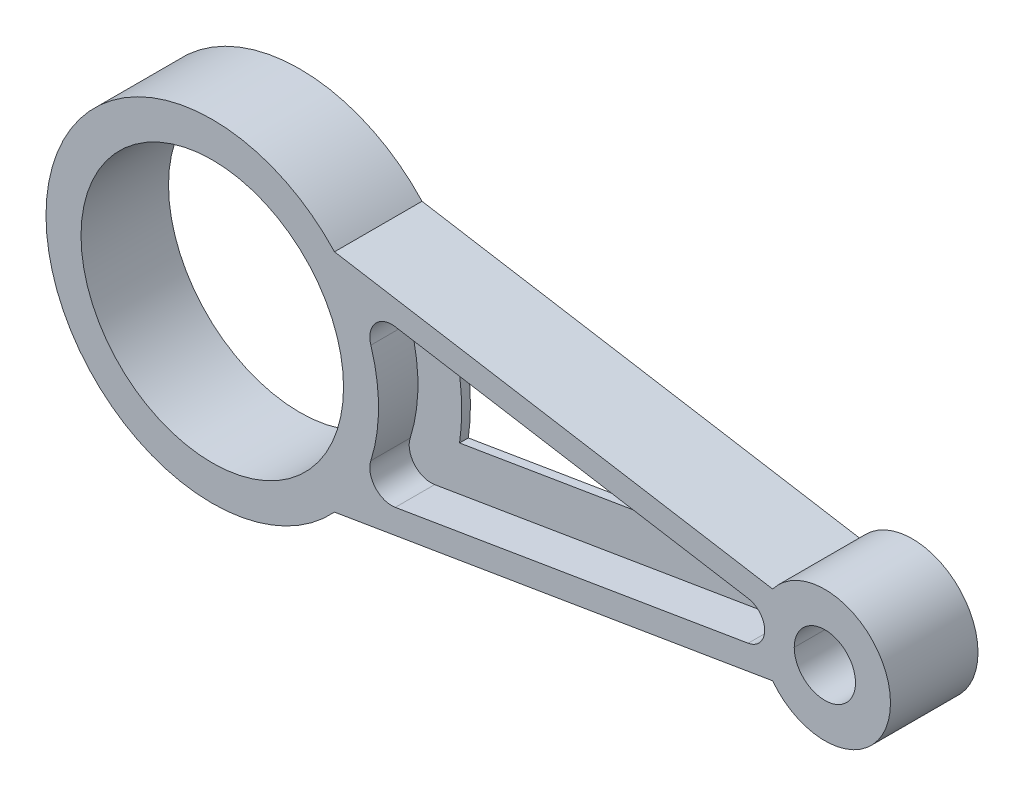
ISO-10303-21;
HEADER;
FILE_DESCRIPTION(('STEP AP214'),'2;1');
FILE_NAME('part.step','',(''),(''),'','','');
FILE_SCHEMA(('AUTOMOTIVE_DESIGN { 1 0 10303 214 1 1 1 1 }'));
ENDSEC;
DATA;
#1=APPLICATION_CONTEXT('core data for automotive mechanical design processes');
#2=APPLICATION_PROTOCOL_DEFINITION('international standard','automotive_design',2000,#1);
#3=PRODUCT_CONTEXT('',#1,'mechanical');
#4=PRODUCT('Part','Part','',(#3));
#5=PRODUCT_RELATED_PRODUCT_CATEGORY('part','',(#4));
#6=PRODUCT_DEFINITION_FORMATION('','',#4);
#7=PRODUCT_DEFINITION_CONTEXT('part definition',#1,'design');
#8=PRODUCT_DEFINITION('design','',#6,#7);
#9=PRODUCT_DEFINITION_SHAPE('','',#8);
#10=(LENGTH_UNIT() NAMED_UNIT(*) SI_UNIT(.MILLI.,.METRE.));
#11=(NAMED_UNIT(*) PLANE_ANGLE_UNIT() SI_UNIT($,.RADIAN.));
#12=(NAMED_UNIT(*) SI_UNIT($,.STERADIAN.) SOLID_ANGLE_UNIT());
#13=UNCERTAINTY_MEASURE_WITH_UNIT(LENGTH_MEASURE(1.E-05),#10,'distance_accuracy_value','');
#14=(GEOMETRIC_REPRESENTATION_CONTEXT(3) GLOBAL_UNCERTAINTY_ASSIGNED_CONTEXT((#13)) GLOBAL_UNIT_ASSIGNED_CONTEXT((#10,
#11,#12)) REPRESENTATION_CONTEXT('',''));
#15=CARTESIAN_POINT('',(0.,0.,0.));
#16=DIRECTION('',(0.,0.,1.));
#17=DIRECTION('',(1.,0.,0.));
#18=AXIS2_PLACEMENT_3D('',#15,#16,#17);
#19=CARTESIAN_POINT('',(41.0071259869049,12.9389187451698,1.));
#20=DIRECTION('',(0.,0.,-1.));
#21=DIRECTION('',(-1.,0.,0.));
#22=AXIS2_PLACEMENT_3D('',#19,#20,#21);
#23=PLANE('',#22);
#24=CARTESIAN_POINT('',(41.0071259869049,12.9389187451698,1.));
#25=DIRECTION('',(0.,0.,1.));
#26=DIRECTION('',(-1.,0.,0.));
#27=AXIS2_PLACEMENT_3D('',#24,#25,#26);
#28=CIRCLE('',#27,5.);
#29=CARTESIAN_POINT('',(41.8285545583335,17.8709827250915,1.));
#30=VERTEX_POINT('',#29);
#31=CARTESIAN_POINT('',(36.2388555233113,11.4343933096849,1.));
#32=VERTEX_POINT('',#31);
#33=EDGE_CURVE('E275',#30,#32,#28,.T.);
#34=ORIENTED_EDGE('',*,*,#33,.T.);
#35=CARTESIAN_POINT('',(0.,0.,1.));
#36=DIRECTION('',(0.,0.,-1.));
#37=DIRECTION('',(-1.,0.,0.));
#38=AXIS2_PLACEMENT_3D('',#35,#36,#37);
#39=CIRCLE('',#38,38.);
#40=CARTESIAN_POINT('',(36.2388555233113,-11.4343933096849,1.));
#41=VERTEX_POINT('',#40);
#42=EDGE_CURVE('E279',#32,#41,#39,.T.);
#43=ORIENTED_EDGE('',*,*,#42,.T.);
#44=CARTESIAN_POINT('',(41.0071259869049,-12.9389187451698,1.));
#45=DIRECTION('',(0.,0.,1.));
#46=DIRECTION('',(1.,0.,0.));
#47=AXIS2_PLACEMENT_3D('',#44,#45,#46);
#48=CIRCLE('',#47,5.);
#49=CARTESIAN_POINT('',(41.8285545583335,-17.8709827250915,1.));
#50=VERTEX_POINT('',#49);
#51=EDGE_CURVE('E284',#41,#50,#48,.T.);
#52=ORIENTED_EDGE('',*,*,#51,.T.);
#53=DIRECTION('',(0.986412795984335,0.164285714285714,0.));
#54=VECTOR('',#53,1.);
#55=CARTESIAN_POINT('',(122.478416149068,-4.4388575819295,1.));
#56=LINE('',#55,#54);
#57=CARTESIAN_POINT('',(122.478416149068,-4.4388575819295,1.));
#58=VERTEX_POINT('',#57);
#59=EDGE_CURVE('E288',#50,#58,#56,.T.);
#60=ORIENTED_EDGE('',*,*,#59,.T.);
#61=CARTESIAN_POINT('',(121.739130434783,0.,1.));
#62=DIRECTION('',(0.,0.,1.));
#63=DIRECTION('',(-1.,0.,0.));
#64=AXIS2_PLACEMENT_3D('',#61,#62,#63);
#65=CIRCLE('',#64,4.49999999999999);
#66=CARTESIAN_POINT('',(122.478416149068,4.4388575819295,1.));
#67=VERTEX_POINT('',#66);
#68=EDGE_CURVE('E292',#58,#67,#65,.T.);
#69=ORIENTED_EDGE('',*,*,#68,.T.);
#70=DIRECTION('',(-0.986412795984335,0.164285714285714,0.));
#71=VECTOR('',#70,1.);
#72=CARTESIAN_POINT('',(41.8285545583335,17.8709827250915,1.));
#73=LINE('',#72,#71);
#74=EDGE_CURVE('E296',#67,#30,#73,.T.);
#75=ORIENTED_EDGE('',*,*,#74,.T.);
#76=EDGE_LOOP('',(#34,#43,#52,#60,#69,#75));
#77=FACE_BOUND('',#76,.T.);
#78=CARTESIAN_POINT('',(0.,0.,1.));
#79=DIRECTION('',(0.,0.,-1.));
#80=DIRECTION('',(1.,0.,0.));
#81=AXIS2_PLACEMENT_3D('',#78,#79,#80);
#82=CIRCLE('',#81,48.);
#83=CARTESIAN_POINT('',(47.5179392364682,6.78567982735085,1.));
#84=VERTEX_POINT('',#83);
#85=CARTESIAN_POINT('',(47.5179392364682,-6.78567982735085,1.));
#86=VERTEX_POINT('',#85);
#87=EDGE_CURVE('E193',#84,#86,#82,.T.);
#88=ORIENTED_EDGE('',*,*,#87,.F.);
#89=DIRECTION('',(-0.986412795984335,0.164285714285714,0.));
#90=VECTOR('',#89,1.);
#91=CARTESIAN_POINT('',(88.2608695652174,0.,1.));
#92=LINE('',#91,#90);
#93=CARTESIAN_POINT('',(88.2608695652174,0.,1.));
#94=VERTEX_POINT('',#93);
#95=EDGE_CURVE('E190',#94,#84,#92,.T.);
#96=ORIENTED_EDGE('',*,*,#95,.F.);
#97=DIRECTION('',(0.986412795984335,0.164285714285714,0.));
#98=VECTOR('',#97,1.);
#99=CARTESIAN_POINT('',(47.5179392364682,-6.78567982735085,1.));
#100=LINE('',#99,#98);
#101=EDGE_CURVE('E59',#86,#94,#100,.T.);
#102=ORIENTED_EDGE('',*,*,#101,.F.);
#103=EDGE_LOOP('',(#88,#96,#102));
#104=FACE_BOUND('',#103,.T.);
#105=ADVANCED_FACE('F43',(#77,#104),#23,.F.);
#106=CARTESIAN_POINT('',(140.,0.,10.));
#107=DIRECTION('',(0.,0.,-1.));
#108=DIRECTION('',(-1.,0.,0.));
#109=AXIS2_PLACEMENT_3D('',#106,#107,#108);
#110=CYLINDRICAL_SURFACE('',#109,7.00000000000001);
#111=CARTESIAN_POINT('',(140.,0.,10.));
#112=DIRECTION('',(0.,0.,1.));
#113=DIRECTION('',(1.,0.,0.));
#114=AXIS2_PLACEMENT_3D('',#111,#112,#113);
#115=CIRCLE('',#114,7.00000000000001);
#116=CARTESIAN_POINT('',(133.,0.,10.));
#117=VERTEX_POINT('',#116);
#118=CARTESIAN_POINT('',(147.,0.,10.));
#119=VERTEX_POINT('',#118);
#120=EDGE_CURVE('E357',#117,#119,#115,.T.);
#121=ORIENTED_EDGE('',*,*,#120,.T.);
#122=DIRECTION('',(0.,0.,-1.));
#123=VECTOR('',#122,1.);
#124=CARTESIAN_POINT('',(147.,0.,10.));
#125=LINE('',#124,#123);
#126=CARTESIAN_POINT('',(147.,0.,-10.));
#127=VERTEX_POINT('',#126);
#128=EDGE_CURVE('E405',#119,#127,#125,.T.);
#129=ORIENTED_EDGE('',*,*,#128,.T.);
#130=CARTESIAN_POINT('',(140.,0.,-10.));
#131=DIRECTION('',(0.,0.,1.));
#132=DIRECTION('',(1.,0.,0.));
#133=AXIS2_PLACEMENT_3D('',#130,#131,#132);
#134=CIRCLE('',#133,7.00000000000001);
#135=CARTESIAN_POINT('',(133.,0.,-10.));
#136=VERTEX_POINT('',#135);
#137=EDGE_CURVE('E381',#136,#127,#134,.T.);
#138=ORIENTED_EDGE('',*,*,#137,.F.);
#139=DIRECTION('',(0.,0.,1.));
#140=VECTOR('',#139,1.);
#141=CARTESIAN_POINT('',(133.,0.,10.));
#142=LINE('',#141,#140);
#143=EDGE_CURVE('E401',#136,#117,#142,.T.);
#144=ORIENTED_EDGE('',*,*,#143,.T.);
#145=EDGE_LOOP('',(#121,#129,#138,#144));
#146=FACE_BOUND('',#145,.T.);
#147=ADVANCED_FACE('F425',(#146),#110,.F.);
#148=CARTESIAN_POINT('',(0.,0.,-10.));
#149=DIRECTION('',(0.,0.,1.));
#150=DIRECTION('',(1.,0.,0.));
#151=AXIS2_PLACEMENT_3D('',#148,#149,#150);
#152=PLANE('',#151);
#153=CARTESIAN_POINT('',(0.,0.,-10.));
#154=DIRECTION('',(0.,0.,1.));
#155=DIRECTION('',(1.,0.,0.));
#156=AXIS2_PLACEMENT_3D('',#153,#154,#155);
#157=CIRCLE('',#156,30.);
#158=CARTESIAN_POINT('',(30.,0.,-10.));
#159=VERTEX_POINT('',#158);
#160=EDGE_CURVE('E346',#159,#159,#157,.T.);
#161=ORIENTED_EDGE('',*,*,#160,.T.);
#162=EDGE_LOOP('',(#161));
#163=FACE_BOUND('',#162,.T.);
#164=ORIENTED_EDGE('',*,*,#137,.T.);
#165=EDGE_CURVE('E380',#127,#136,#134,.T.);
#166=ORIENTED_EDGE('',*,*,#165,.T.);
#167=EDGE_LOOP('',(#164,#166));
#168=FACE_BOUND('',#167,.T.);
#169=DIRECTION('',(0.986412795984335,0.164285714285714,0.));
#170=VECTOR('',#169,1.);
#171=CARTESIAN_POINT('',(4.92857142857142,-29.59238387953,-10.));
#172=LINE('',#171,#170);
#173=CARTESIAN_POINT('',(27.9354736759495,-25.7606154914888,-10.));
#174=VERTEX_POINT('',#173);
#175=CARTESIAN_POINT('',(128.063755469258,-9.08438586269532,-10.));
#176=VERTEX_POINT('',#175);
#177=EDGE_CURVE('E325',#174,#176,#172,.T.);
#178=ORIENTED_EDGE('',*,*,#177,.F.);
#179=CARTESIAN_POINT('',(0.,0.,-10.));
#180=DIRECTION('',(0.,0.,1.));
#181=DIRECTION('',(1.,0.,0.));
#182=AXIS2_PLACEMENT_3D('',#179,#180,#181);
#183=CIRCLE('',#182,38.);
#184=CARTESIAN_POINT('',(27.9354736759495,25.7606154914888,-10.));
#185=VERTEX_POINT('',#184);
#186=EDGE_CURVE('E377',#185,#174,#183,.T.);
#187=ORIENTED_EDGE('',*,*,#186,.F.);
#188=DIRECTION('',(0.986412795984335,-0.164285714285714,0.));
#189=VECTOR('',#188,1.);
#190=CARTESIAN_POINT('',(4.92857142857142,29.59238387953,-10.));
#191=LINE('',#190,#189);
#192=CARTESIAN_POINT('',(128.063755469258,9.08438586269533,-10.));
#193=VERTEX_POINT('',#192);
#194=EDGE_CURVE('E373',#185,#193,#191,.T.);
#195=ORIENTED_EDGE('',*,*,#194,.T.);
#196=CARTESIAN_POINT('',(140.,0.,-10.));
#197=DIRECTION('',(0.,0.,1.));
#198=DIRECTION('',(1.,0.,0.));
#199=AXIS2_PLACEMENT_3D('',#196,#197,#198);
#200=CIRCLE('',#199,15.);
#201=EDGE_CURVE('E369',#176,#193,#200,.T.);
#202=ORIENTED_EDGE('',*,*,#201,.F.);
#203=EDGE_LOOP('',(#178,#187,#195,#202));
#204=FACE_BOUND('',#203,.T.);
#205=CARTESIAN_POINT('',(41.0071259869049,12.9389187451698,-10.));
#206=DIRECTION('',(0.,0.,1.));
#207=DIRECTION('',(-1.,0.,0.));
#208=AXIS2_PLACEMENT_3D('',#205,#206,#207);
#209=CIRCLE('',#208,5.);
#210=CARTESIAN_POINT('',(41.8285545583335,17.8709827250915,-10.));
#211=VERTEX_POINT('',#210);
#212=CARTESIAN_POINT('',(36.2388555233113,11.4343933096849,-10.));
#213=VERTEX_POINT('',#212);
#214=EDGE_CURVE('E209',#211,#213,#209,.T.);
#215=ORIENTED_EDGE('',*,*,#214,.T.);
#216=CARTESIAN_POINT('',(0.,0.,-10.));
#217=DIRECTION('',(0.,0.,-1.));
#218=DIRECTION('',(-1.,0.,0.));
#219=AXIS2_PLACEMENT_3D('',#216,#217,#218);
#220=CIRCLE('',#219,38.);
#221=CARTESIAN_POINT('',(36.2388555233113,-11.4343933096849,-10.));
#222=VERTEX_POINT('',#221);
#223=EDGE_CURVE('E217',#213,#222,#220,.T.);
#224=ORIENTED_EDGE('',*,*,#223,.T.);
#225=CARTESIAN_POINT('',(41.0071259869049,-12.9389187451698,-10.));
#226=DIRECTION('',(0.,0.,1.));
#227=DIRECTION('',(1.,0.,0.));
#228=AXIS2_PLACEMENT_3D('',#225,#226,#227);
#229=CIRCLE('',#228,5.);
#230=CARTESIAN_POINT('',(41.8285545583335,-17.8709827250915,-10.));
#231=VERTEX_POINT('',#230);
#232=EDGE_CURVE('E248',#222,#231,#229,.T.);
#233=ORIENTED_EDGE('',*,*,#232,.T.);
#234=DIRECTION('',(0.986412795984335,0.164285714285714,0.));
#235=VECTOR('',#234,1.);
#236=CARTESIAN_POINT('',(122.478416149068,-4.4388575819295,-10.));
#237=LINE('',#236,#235);
#238=CARTESIAN_POINT('',(122.478416149068,-4.4388575819295,-10.));
#239=VERTEX_POINT('',#238);
#240=EDGE_CURVE('E244',#231,#239,#237,.T.);
#241=ORIENTED_EDGE('',*,*,#240,.T.);
#242=CARTESIAN_POINT('',(121.739130434783,0.,-10.));
#243=DIRECTION('',(0.,0.,1.));
#244=DIRECTION('',(-1.,0.,0.));
#245=AXIS2_PLACEMENT_3D('',#242,#243,#244);
#246=CIRCLE('',#245,4.49999999999999);
#247=CARTESIAN_POINT('',(122.478416149068,4.4388575819295,-10.));
#248=VERTEX_POINT('',#247);
#249=EDGE_CURVE('E240',#239,#248,#246,.T.);
#250=ORIENTED_EDGE('',*,*,#249,.T.);
#251=DIRECTION('',(-0.986412795984335,0.164285714285714,0.));
#252=VECTOR('',#251,1.);
#253=CARTESIAN_POINT('',(41.8285545583335,17.8709827250915,-10.));
#254=LINE('',#253,#252);
#255=EDGE_CURVE('E236',#248,#211,#254,.T.);
#256=ORIENTED_EDGE('',*,*,#255,.T.);
#257=EDGE_LOOP('',(#215,#224,#233,#241,#250,#256));
#258=FACE_BOUND('',#257,.T.);
#259=ADVANCED_FACE('F431',(#163,#168,#204,#258),#152,.F.);
#260=CARTESIAN_POINT('',(0.,0.,10.));
#261=DIRECTION('',(0.,0.,1.));
#262=DIRECTION('',(1.,0.,0.));
#263=AXIS2_PLACEMENT_3D('',#260,#261,#262);
#264=PLANE('',#263);
#265=CARTESIAN_POINT('',(0.,0.,10.));
#266=DIRECTION('',(0.,0.,1.));
#267=DIRECTION('',(1.,0.,0.));
#268=AXIS2_PLACEMENT_3D('',#265,#266,#267);
#269=CIRCLE('',#268,30.);
#270=CARTESIAN_POINT('',(30.,0.,10.));
#271=VERTEX_POINT('',#270);
#272=EDGE_CURVE('E361',#271,#271,#269,.T.);
#273=ORIENTED_EDGE('',*,*,#272,.F.);
#274=EDGE_LOOP('',(#273));
#275=FACE_BOUND('',#274,.T.);
#276=ORIENTED_EDGE('',*,*,#120,.F.);
#277=EDGE_CURVE('E356',#119,#117,#115,.T.);
#278=ORIENTED_EDGE('',*,*,#277,.F.);
#279=EDGE_LOOP('',(#276,#278));
#280=FACE_BOUND('',#279,.T.);
#281=DIRECTION('',(0.986412795984335,0.164285714285714,0.));
#282=VECTOR('',#281,1.);
#283=CARTESIAN_POINT('',(4.92857142857142,-29.59238387953,10.));
#284=LINE('',#283,#282);
#285=CARTESIAN_POINT('',(27.9354736759495,-25.7606154914888,10.));
#286=VERTEX_POINT('',#285);
#287=CARTESIAN_POINT('',(128.063755469258,-9.08438586269532,10.));
#288=VERTEX_POINT('',#287);
#289=EDGE_CURVE('E341',#286,#288,#284,.T.);
#290=ORIENTED_EDGE('',*,*,#289,.T.);
#291=CARTESIAN_POINT('',(140.,0.,10.));
#292=DIRECTION('',(0.,0.,1.));
#293=DIRECTION('',(1.,0.,0.));
#294=AXIS2_PLACEMENT_3D('',#291,#292,#293);
#295=CIRCLE('',#294,15.);
#296=CARTESIAN_POINT('',(128.063755469258,9.08438586269533,10.));
#297=VERTEX_POINT('',#296);
#298=EDGE_CURVE('E345',#288,#297,#295,.T.);
#299=ORIENTED_EDGE('',*,*,#298,.T.);
#300=DIRECTION('',(0.986412795984335,-0.164285714285714,0.));
#301=VECTOR('',#300,1.);
#302=CARTESIAN_POINT('',(4.92857142857142,29.59238387953,10.));
#303=LINE('',#302,#301);
#304=CARTESIAN_POINT('',(27.9354736759495,25.7606154914888,10.));
#305=VERTEX_POINT('',#304);
#306=EDGE_CURVE('E349',#305,#297,#303,.T.);
#307=ORIENTED_EDGE('',*,*,#306,.F.);
#308=CARTESIAN_POINT('',(0.,0.,10.));
#309=DIRECTION('',(0.,0.,1.));
#310=DIRECTION('',(1.,0.,0.));
#311=AXIS2_PLACEMENT_3D('',#308,#309,#310);
#312=CIRCLE('',#311,38.);
#313=EDGE_CURVE('E353',#305,#286,#312,.T.);
#314=ORIENTED_EDGE('',*,*,#313,.T.);
#315=EDGE_LOOP('',(#290,#299,#307,#314));
#316=FACE_BOUND('',#315,.T.);
#317=CARTESIAN_POINT('',(41.0071259869049,12.9389187451698,10.));
#318=DIRECTION('',(0.,0.,1.));
#319=DIRECTION('',(-1.,0.,0.));
#320=AXIS2_PLACEMENT_3D('',#317,#318,#319);
#321=CIRCLE('',#320,5.);
#322=CARTESIAN_POINT('',(41.8285545583335,17.8709827250915,10.));
#323=VERTEX_POINT('',#322);
#324=CARTESIAN_POINT('',(36.2388555233113,11.4343933096849,10.));
#325=VERTEX_POINT('',#324);
#326=EDGE_CURVE('E259',#323,#325,#321,.T.);
#327=ORIENTED_EDGE('',*,*,#326,.F.);
#328=DIRECTION('',(-0.986412795984335,0.164285714285714,0.));
#329=VECTOR('',#328,1.);
#330=CARTESIAN_POINT('',(41.8285545583335,17.8709827250915,10.));
#331=LINE('',#330,#329);
#332=CARTESIAN_POINT('',(122.478416149068,4.4388575819295,10.));
#333=VERTEX_POINT('',#332);
#334=EDGE_CURVE('E280',#333,#323,#331,.T.);
#335=ORIENTED_EDGE('',*,*,#334,.F.);
#336=CARTESIAN_POINT('',(121.739130434783,0.,10.));
#337=DIRECTION('',(0.,0.,1.));
#338=DIRECTION('',(-1.,0.,0.));
#339=AXIS2_PLACEMENT_3D('',#336,#337,#338);
#340=CIRCLE('',#339,4.49999999999999);
#341=CARTESIAN_POINT('',(122.478416149068,-4.4388575819295,10.));
#342=VERTEX_POINT('',#341);
#343=EDGE_CURVE('E315',#342,#333,#340,.T.);
#344=ORIENTED_EDGE('',*,*,#343,.F.);
#345=DIRECTION('',(0.986412795984335,0.164285714285714,0.));
#346=VECTOR('',#345,1.);
#347=CARTESIAN_POINT('',(122.478416149068,-4.4388575819295,10.));
#348=LINE('',#347,#346);
#349=CARTESIAN_POINT('',(41.8285545583335,-17.8709827250915,10.));
#350=VERTEX_POINT('',#349);
#351=EDGE_CURVE('E311',#350,#342,#348,.T.);
#352=ORIENTED_EDGE('',*,*,#351,.F.);
#353=CARTESIAN_POINT('',(41.0071259869049,-12.9389187451698,10.));
#354=DIRECTION('',(0.,0.,1.));
#355=DIRECTION('',(1.,0.,0.));
#356=AXIS2_PLACEMENT_3D('',#353,#354,#355);
#357=CIRCLE('',#356,5.);
#358=CARTESIAN_POINT('',(36.2388555233113,-11.4343933096849,10.));
#359=VERTEX_POINT('',#358);
#360=EDGE_CURVE('E307',#359,#350,#357,.T.);
#361=ORIENTED_EDGE('',*,*,#360,.F.);
#362=CARTESIAN_POINT('',(0.,0.,10.));
#363=DIRECTION('',(0.,0.,-1.));
#364=DIRECTION('',(-1.,0.,0.));
#365=AXIS2_PLACEMENT_3D('',#362,#363,#364);
#366=CIRCLE('',#365,38.);
#367=EDGE_CURVE('E303',#325,#359,#366,.T.);
#368=ORIENTED_EDGE('',*,*,#367,.F.);
#369=EDGE_LOOP('',(#327,#335,#344,#352,#361,#368));
#370=FACE_BOUND('',#369,.T.);
#371=ADVANCED_FACE('F464',(#275,#280,#316,#370),#264,.T.);
#372=CARTESIAN_POINT('',(4.92857142857142,-29.59238387953,10.));
#373=DIRECTION('',(-0.164285714285714,0.986412795984335,0.));
#374=DIRECTION('',(-0.986412795984335,-0.164285714285714,0.));
#375=AXIS2_PLACEMENT_3D('',#372,#373,#374);
#376=PLANE('',#375);
#377=ORIENTED_EDGE('',*,*,#177,.T.);
#378=DIRECTION('',(0.,0.,-1.));
#379=VECTOR('',#378,1.);
#380=CARTESIAN_POINT('',(128.063755469258,-9.08438586269532,10.));
#381=LINE('',#380,#379);
#382=EDGE_CURVE('E397',#288,#176,#381,.T.);
#383=ORIENTED_EDGE('',*,*,#382,.F.);
#384=ORIENTED_EDGE('',*,*,#289,.F.);
#385=DIRECTION('',(0.,0.,-1.));
#386=VECTOR('',#385,1.);
#387=CARTESIAN_POINT('',(27.9354736759495,-25.7606154914888,10.));
#388=LINE('',#387,#386);
#389=EDGE_CURVE('E365',#286,#174,#388,.T.);
#390=ORIENTED_EDGE('',*,*,#389,.T.);
#391=EDGE_LOOP('',(#377,#383,#384,#390));
#392=FACE_BOUND('',#391,.T.);
#393=ADVANCED_FACE('F45',(#392),#376,.F.);
#394=CARTESIAN_POINT('',(140.,0.,10.));
#395=DIRECTION('',(0.,0.,-1.));
#396=DIRECTION('',(-1.,0.,0.));
#397=AXIS2_PLACEMENT_3D('',#394,#395,#396);
#398=CYLINDRICAL_SURFACE('',#397,15.);
#399=ORIENTED_EDGE('',*,*,#201,.T.);
#400=DIRECTION('',(0.,0.,-1.));
#401=VECTOR('',#400,1.);
#402=CARTESIAN_POINT('',(128.063755469258,9.08438586269533,10.));
#403=LINE('',#402,#401);
#404=EDGE_CURVE('E394',#297,#193,#403,.T.);
#405=ORIENTED_EDGE('',*,*,#404,.F.);
#406=ORIENTED_EDGE('',*,*,#298,.F.);
#407=ORIENTED_EDGE('',*,*,#382,.T.);
#408=EDGE_LOOP('',(#399,#405,#406,#407));
#409=FACE_BOUND('',#408,.T.);
#410=ADVANCED_FACE('F482',(#409),#398,.T.);
#411=CARTESIAN_POINT('',(4.92857142857142,29.59238387953,10.));
#412=DIRECTION('',(0.164285714285714,0.986412795984335,0.));
#413=DIRECTION('',(-0.986412795984335,0.164285714285714,0.));
#414=AXIS2_PLACEMENT_3D('',#411,#412,#413);
#415=PLANE('',#414);
#416=ORIENTED_EDGE('',*,*,#194,.F.);
#417=DIRECTION('',(0.,0.,-1.));
#418=VECTOR('',#417,1.);
#419=CARTESIAN_POINT('',(27.9354736759495,25.7606154914888,10.));
#420=LINE('',#419,#418);
#421=EDGE_CURVE('E391',#305,#185,#420,.T.);
#422=ORIENTED_EDGE('',*,*,#421,.F.);
#423=ORIENTED_EDGE('',*,*,#306,.T.);
#424=ORIENTED_EDGE('',*,*,#404,.T.);
#425=EDGE_LOOP('',(#416,#422,#423,#424));
#426=FACE_BOUND('',#425,.T.);
#427=ADVANCED_FACE('F476',(#426),#415,.T.);
#428=ORIENTED_EDGE('',*,*,#128,.F.);
#429=ORIENTED_EDGE('',*,*,#277,.T.);
#430=ORIENTED_EDGE('',*,*,#143,.F.);
#431=ORIENTED_EDGE('',*,*,#165,.F.);
#432=EDGE_LOOP('',(#428,#429,#430,#431));
#433=FACE_BOUND('',#432,.T.);
#434=ADVANCED_FACE('F434',(#433),#110,.F.);
#435=CARTESIAN_POINT('',(0.,0.,10.));
#436=DIRECTION('',(0.,0.,-1.));
#437=DIRECTION('',(-1.,0.,0.));
#438=AXIS2_PLACEMENT_3D('',#435,#436,#437);
#439=CYLINDRICAL_SURFACE('',#438,38.);
#440=ORIENTED_EDGE('',*,*,#186,.T.);
#441=ORIENTED_EDGE('',*,*,#389,.F.);
#442=ORIENTED_EDGE('',*,*,#313,.F.);
#443=ORIENTED_EDGE('',*,*,#421,.T.);
#444=EDGE_LOOP('',(#440,#441,#442,#443));
#445=FACE_BOUND('',#444,.T.);
#446=ADVANCED_FACE('F472',(#445),#439,.T.);
#447=CARTESIAN_POINT('',(0.,0.,10.));
#448=DIRECTION('',(0.,0.,-1.));
#449=DIRECTION('',(-1.,0.,0.));
#450=AXIS2_PLACEMENT_3D('',#447,#448,#449);
#451=CYLINDRICAL_SURFACE('',#450,30.);
#452=ORIENTED_EDGE('',*,*,#272,.T.);
#453=EDGE_LOOP('',(#452));
#454=FACE_BOUND('',#453,.T.);
#455=ORIENTED_EDGE('',*,*,#160,.F.);
#456=EDGE_LOOP('',(#455));
#457=FACE_BOUND('',#456,.T.);
#458=ADVANCED_FACE('F462',(#454,#457),#451,.F.);
#459=CARTESIAN_POINT('',(41.0071259869049,12.9389187451698,1.));
#460=DIRECTION('',(0.,0.,1.));
#461=DIRECTION('',(1.,0.,0.));
#462=AXIS2_PLACEMENT_3D('',#459,#460,#461);
#463=CYLINDRICAL_SURFACE('',#462,5.);
#464=ORIENTED_EDGE('',*,*,#326,.T.);
#465=DIRECTION('',(0.,0.,1.));
#466=VECTOR('',#465,1.);
#467=CARTESIAN_POINT('',(36.2388555233113,11.4343933096849,1.));
#468=LINE('',#467,#466);
#469=EDGE_CURVE('E300',#32,#325,#468,.T.);
#470=ORIENTED_EDGE('',*,*,#469,.F.);
#471=ORIENTED_EDGE('',*,*,#33,.F.);
#472=DIRECTION('',(0.,0.,1.));
#473=VECTOR('',#472,1.);
#474=CARTESIAN_POINT('',(41.8285545583335,17.8709827250915,1.));
#475=LINE('',#474,#473);
#476=EDGE_CURVE('E322',#30,#323,#475,.T.);
#477=ORIENTED_EDGE('',*,*,#476,.T.);
#478=EDGE_LOOP('',(#464,#470,#471,#477));
#479=FACE_BOUND('',#478,.T.);
#480=ADVANCED_FACE('F443',(#479),#463,.F.);
#481=CARTESIAN_POINT('',(41.8285545583335,17.8709827250915,1.));
#482=DIRECTION('',(0.164285714285714,0.986412795984335,0.));
#483=DIRECTION('',(-0.986412795984335,0.164285714285714,0.));
#484=AXIS2_PLACEMENT_3D('',#481,#482,#483);
#485=PLANE('',#484);
#486=ORIENTED_EDGE('',*,*,#334,.T.);
#487=ORIENTED_EDGE('',*,*,#476,.F.);
#488=ORIENTED_EDGE('',*,*,#74,.F.);
#489=DIRECTION('',(0.,0.,1.));
#490=VECTOR('',#489,1.);
#491=CARTESIAN_POINT('',(122.478416149068,4.4388575819295,1.));
#492=LINE('',#491,#490);
#493=EDGE_CURVE('E326',#67,#333,#492,.T.);
#494=ORIENTED_EDGE('',*,*,#493,.T.);
#495=EDGE_LOOP('',(#486,#487,#488,#494));
#496=FACE_BOUND('',#495,.T.);
#497=ADVANCED_FACE('F439',(#496),#485,.F.);
#498=CARTESIAN_POINT('',(121.739130434783,0.,1.));
#499=DIRECTION('',(0.,0.,1.));
#500=DIRECTION('',(1.,0.,0.));
#501=AXIS2_PLACEMENT_3D('',#498,#499,#500);
#502=CYLINDRICAL_SURFACE('',#501,4.49999999999999);
#503=ORIENTED_EDGE('',*,*,#343,.T.);
#504=ORIENTED_EDGE('',*,*,#493,.F.);
#505=ORIENTED_EDGE('',*,*,#68,.F.);
#506=DIRECTION('',(0.,0.,1.));
#507=VECTOR('',#506,1.);
#508=CARTESIAN_POINT('',(122.478416149068,-4.4388575819295,1.));
#509=LINE('',#508,#507);
#510=EDGE_CURVE('E329',#58,#342,#509,.T.);
#511=ORIENTED_EDGE('',*,*,#510,.T.);
#512=EDGE_LOOP('',(#503,#504,#505,#511));
#513=FACE_BOUND('',#512,.T.);
#514=ADVANCED_FACE('F442',(#513),#502,.F.);
#515=CARTESIAN_POINT('',(122.478416149068,-4.4388575819295,1.));
#516=DIRECTION('',(0.164285714285714,-0.986412795984335,0.));
#517=DIRECTION('',(0.986412795984335,0.164285714285714,0.));
#518=AXIS2_PLACEMENT_3D('',#515,#516,#517);
#519=PLANE('',#518);
#520=ORIENTED_EDGE('',*,*,#351,.T.);
#521=ORIENTED_EDGE('',*,*,#510,.F.);
#522=ORIENTED_EDGE('',*,*,#59,.F.);
#523=DIRECTION('',(0.,0.,1.));
#524=VECTOR('',#523,1.);
#525=CARTESIAN_POINT('',(41.8285545583335,-17.8709827250915,1.));
#526=LINE('',#525,#524);
#527=EDGE_CURVE('E332',#50,#350,#526,.T.);
#528=ORIENTED_EDGE('',*,*,#527,.T.);
#529=EDGE_LOOP('',(#520,#521,#522,#528));
#530=FACE_BOUND('',#529,.T.);
#531=ADVANCED_FACE('F447',(#530),#519,.F.);
#532=CARTESIAN_POINT('',(41.0071259869049,-12.9389187451698,1.));
#533=DIRECTION('',(0.,0.,1.));
#534=DIRECTION('',(1.,0.,0.));
#535=AXIS2_PLACEMENT_3D('',#532,#533,#534);
#536=CYLINDRICAL_SURFACE('',#535,5.);
#537=ORIENTED_EDGE('',*,*,#360,.T.);
#538=ORIENTED_EDGE('',*,*,#527,.F.);
#539=ORIENTED_EDGE('',*,*,#51,.F.);
#540=DIRECTION('',(0.,0.,1.));
#541=VECTOR('',#540,1.);
#542=CARTESIAN_POINT('',(36.2388555233113,-11.4343933096849,1.));
#543=LINE('',#542,#541);
#544=EDGE_CURVE('E335',#41,#359,#543,.T.);
#545=ORIENTED_EDGE('',*,*,#544,.T.);
#546=EDGE_LOOP('',(#537,#538,#539,#545));
#547=FACE_BOUND('',#546,.T.);
#548=ADVANCED_FACE('F451',(#547),#536,.F.);
#549=CARTESIAN_POINT('',(0.,0.,1.));
#550=DIRECTION('',(0.,0.,1.));
#551=DIRECTION('',(1.,0.,0.));
#552=AXIS2_PLACEMENT_3D('',#549,#550,#551);
#553=CYLINDRICAL_SURFACE('',#552,38.);
#554=ORIENTED_EDGE('',*,*,#367,.T.);
#555=ORIENTED_EDGE('',*,*,#544,.F.);
#556=ORIENTED_EDGE('',*,*,#42,.F.);
#557=ORIENTED_EDGE('',*,*,#469,.T.);
#558=EDGE_LOOP('',(#554,#555,#556,#557));
#559=FACE_BOUND('',#558,.T.);
#560=ADVANCED_FACE('F455',(#559),#553,.T.);
#561=CARTESIAN_POINT('',(41.0071259869049,12.9389187451698,-1.));
#562=DIRECTION('',(0.,0.,-1.));
#563=DIRECTION('',(-1.,0.,0.));
#564=AXIS2_PLACEMENT_3D('',#561,#562,#563);
#565=CYLINDRICAL_SURFACE('',#564,5.);
#566=ORIENTED_EDGE('',*,*,#214,.F.);
#567=DIRECTION('',(0.,0.,-1.));
#568=VECTOR('',#567,1.);
#569=CARTESIAN_POINT('',(41.8285545583335,17.8709827250915,-1.));
#570=LINE('',#569,#568);
#571=CARTESIAN_POINT('',(41.8285545583335,17.8709827250915,-1.));
#572=VERTEX_POINT('',#571);
#573=EDGE_CURVE('E232',#572,#211,#570,.T.);
#574=ORIENTED_EDGE('',*,*,#573,.F.);
#575=CARTESIAN_POINT('',(41.0071259869049,12.9389187451698,-1.));
#576=DIRECTION('',(0.,0.,1.));
#577=DIRECTION('',(-1.,0.,0.));
#578=AXIS2_PLACEMENT_3D('',#575,#576,#577);
#579=CIRCLE('',#578,5.);
#580=CARTESIAN_POINT('',(36.2388555233113,11.4343933096849,-1.));
#581=VERTEX_POINT('',#580);
#582=EDGE_CURVE('E212',#572,#581,#579,.T.);
#583=ORIENTED_EDGE('',*,*,#582,.T.);
#584=DIRECTION('',(0.,0.,-1.));
#585=VECTOR('',#584,1.);
#586=CARTESIAN_POINT('',(36.2388555233113,11.4343933096849,-1.));
#587=LINE('',#586,#585);
#588=EDGE_CURVE('E255',#581,#213,#587,.T.);
#589=ORIENTED_EDGE('',*,*,#588,.T.);
#590=EDGE_LOOP('',(#566,#574,#583,#589));
#591=FACE_BOUND('',#590,.T.);
#592=ADVANCED_FACE('F437',(#591),#565,.F.);
#593=CARTESIAN_POINT('',(0.,0.,-1.));
#594=DIRECTION('',(0.,0.,-1.));
#595=DIRECTION('',(-1.,0.,0.));
#596=AXIS2_PLACEMENT_3D('',#593,#594,#595);
#597=CYLINDRICAL_SURFACE('',#596,38.);
#598=ORIENTED_EDGE('',*,*,#223,.F.);
#599=ORIENTED_EDGE('',*,*,#588,.F.);
#600=CARTESIAN_POINT('',(0.,0.,-1.));
#601=DIRECTION('',(0.,0.,-1.));
#602=DIRECTION('',(-1.,0.,0.));
#603=AXIS2_PLACEMENT_3D('',#600,#601,#602);
#604=CIRCLE('',#603,38.);
#605=CARTESIAN_POINT('',(36.2388555233113,-11.4343933096849,-1.));
#606=VERTEX_POINT('',#605);
#607=EDGE_CURVE('E229',#581,#606,#604,.T.);
#608=ORIENTED_EDGE('',*,*,#607,.T.);
#609=DIRECTION('',(0.,0.,-1.));
#610=VECTOR('',#609,1.);
#611=CARTESIAN_POINT('',(36.2388555233113,-11.4343933096849,-1.));
#612=LINE('',#611,#610);
#613=EDGE_CURVE('E260',#606,#222,#612,.T.);
#614=ORIENTED_EDGE('',*,*,#613,.T.);
#615=EDGE_LOOP('',(#598,#599,#608,#614));
#616=FACE_BOUND('',#615,.T.);
#617=ADVANCED_FACE('F528',(#616),#597,.T.);
#618=CARTESIAN_POINT('',(41.0071259869049,-12.9389187451698,-1.));
#619=DIRECTION('',(0.,0.,-1.));
#620=DIRECTION('',(-1.,0.,0.));
#621=AXIS2_PLACEMENT_3D('',#618,#619,#620);
#622=CYLINDRICAL_SURFACE('',#621,5.);
#623=ORIENTED_EDGE('',*,*,#232,.F.);
#624=ORIENTED_EDGE('',*,*,#613,.F.);
#625=CARTESIAN_POINT('',(41.0071259869049,-12.9389187451698,-1.));
#626=DIRECTION('',(0.,0.,1.));
#627=DIRECTION('',(1.,0.,0.));
#628=AXIS2_PLACEMENT_3D('',#625,#626,#627);
#629=CIRCLE('',#628,5.);
#630=CARTESIAN_POINT('',(41.8285545583335,-17.8709827250915,-1.));
#631=VERTEX_POINT('',#630);
#632=EDGE_CURVE('E226',#606,#631,#629,.T.);
#633=ORIENTED_EDGE('',*,*,#632,.T.);
#634=DIRECTION('',(0.,0.,-1.));
#635=VECTOR('',#634,1.);
#636=CARTESIAN_POINT('',(41.8285545583335,-17.8709827250915,-1.));
#637=LINE('',#636,#635);
#638=EDGE_CURVE('E263',#631,#231,#637,.T.);
#639=ORIENTED_EDGE('',*,*,#638,.T.);
#640=EDGE_LOOP('',(#623,#624,#633,#639));
#641=FACE_BOUND('',#640,.T.);
#642=ADVANCED_FACE('F532',(#641),#622,.F.);
#643=CARTESIAN_POINT('',(122.478416149068,-4.4388575819295,-1.));
#644=DIRECTION('',(-0.164285714285714,0.986412795984335,0.));
#645=DIRECTION('',(-0.986412795984335,-0.164285714285714,0.));
#646=AXIS2_PLACEMENT_3D('',#643,#644,#645);
#647=PLANE('',#646);
#648=ORIENTED_EDGE('',*,*,#240,.F.);
#649=ORIENTED_EDGE('',*,*,#638,.F.);
#650=DIRECTION('',(0.986412795984335,0.164285714285714,0.));
#651=VECTOR('',#650,1.);
#652=CARTESIAN_POINT('',(122.478416149068,-4.4388575819295,-1.));
#653=LINE('',#652,#651);
#654=CARTESIAN_POINT('',(122.478416149068,-4.4388575819295,-1.));
#655=VERTEX_POINT('',#654);
#656=EDGE_CURVE('E223',#631,#655,#653,.T.);
#657=ORIENTED_EDGE('',*,*,#656,.T.);
#658=DIRECTION('',(0.,0.,-1.));
#659=VECTOR('',#658,1.);
#660=CARTESIAN_POINT('',(122.478416149068,-4.4388575819295,-1.));
#661=LINE('',#660,#659);
#662=EDGE_CURVE('E266',#655,#239,#661,.T.);
#663=ORIENTED_EDGE('',*,*,#662,.T.);
#664=EDGE_LOOP('',(#648,#649,#657,#663));
#665=FACE_BOUND('',#664,.T.);
#666=ADVANCED_FACE('F537',(#665),#647,.T.);
#667=CARTESIAN_POINT('',(121.739130434783,0.,-1.));
#668=DIRECTION('',(0.,0.,-1.));
#669=DIRECTION('',(-1.,0.,0.));
#670=AXIS2_PLACEMENT_3D('',#667,#668,#669);
#671=CYLINDRICAL_SURFACE('',#670,4.49999999999999);
#672=ORIENTED_EDGE('',*,*,#249,.F.);
#673=ORIENTED_EDGE('',*,*,#662,.F.);
#674=CARTESIAN_POINT('',(121.739130434783,0.,-1.));
#675=DIRECTION('',(0.,0.,1.));
#676=DIRECTION('',(-1.,0.,0.));
#677=AXIS2_PLACEMENT_3D('',#674,#675,#676);
#678=CIRCLE('',#677,4.49999999999999);
#679=CARTESIAN_POINT('',(122.478416149068,4.4388575819295,-1.));
#680=VERTEX_POINT('',#679);
#681=EDGE_CURVE('E220',#655,#680,#678,.T.);
#682=ORIENTED_EDGE('',*,*,#681,.T.);
#683=DIRECTION('',(0.,0.,-1.));
#684=VECTOR('',#683,1.);
#685=CARTESIAN_POINT('',(122.478416149068,4.4388575819295,-1.));
#686=LINE('',#685,#684);
#687=EDGE_CURVE('E269',#680,#248,#686,.T.);
#688=ORIENTED_EDGE('',*,*,#687,.T.);
#689=EDGE_LOOP('',(#672,#673,#682,#688));
#690=FACE_BOUND('',#689,.T.);
#691=ADVANCED_FACE('F540',(#690),#671,.F.);
#692=CARTESIAN_POINT('',(41.8285545583335,17.8709827250915,-1.));
#693=DIRECTION('',(-0.164285714285714,-0.986412795984335,0.));
#694=DIRECTION('',(0.986412795984335,-0.164285714285714,0.));
#695=AXIS2_PLACEMENT_3D('',#692,#693,#694);
#696=PLANE('',#695);
#697=ORIENTED_EDGE('',*,*,#255,.F.);
#698=ORIENTED_EDGE('',*,*,#687,.F.);
#699=DIRECTION('',(-0.986412795984335,0.164285714285714,0.));
#700=VECTOR('',#699,1.);
#701=CARTESIAN_POINT('',(41.8285545583335,17.8709827250915,-1.));
#702=LINE('',#701,#700);
#703=EDGE_CURVE('E216',#680,#572,#702,.T.);
#704=ORIENTED_EDGE('',*,*,#703,.T.);
#705=ORIENTED_EDGE('',*,*,#573,.T.);
#706=EDGE_LOOP('',(#697,#698,#704,#705));
#707=FACE_BOUND('',#706,.T.);
#708=ADVANCED_FACE('F521',(#707),#696,.T.);
#709=CARTESIAN_POINT('',(41.0071259869049,12.9389187451698,-1.));
#710=DIRECTION('',(0.,0.,1.));
#711=DIRECTION('',(-1.,0.,0.));
#712=AXIS2_PLACEMENT_3D('',#709,#710,#711);
#713=PLANE('',#712);
#714=DIRECTION('',(-0.986412795984335,0.164285714285714,0.));
#715=VECTOR('',#714,1.);
#716=CARTESIAN_POINT('',(40.1856974154764,8.0068547652481,-1.));
#717=LINE('',#716,#715);
#718=CARTESIAN_POINT('',(88.2608695652174,0.,-1.));
#719=VERTEX_POINT('',#718);
#720=CARTESIAN_POINT('',(47.5179392364682,6.78567982735085,-1.));
#721=VERTEX_POINT('',#720);
#722=EDGE_CURVE('E52',#719,#721,#717,.T.);
#723=ORIENTED_EDGE('',*,*,#722,.T.);
#724=CARTESIAN_POINT('',(0.,0.,-1.));
#725=DIRECTION('',(0.,0.,1.));
#726=DIRECTION('',(1.,0.,0.));
#727=AXIS2_PLACEMENT_3D('',#724,#725,#726);
#728=CIRCLE('',#727,48.);
#729=CARTESIAN_POINT('',(47.5179392364682,-6.78567982735085,-1.));
#730=VERTEX_POINT('',#729);
#731=EDGE_CURVE('E11',#721,#730,#728,.F.);
#732=ORIENTED_EDGE('',*,*,#731,.T.);
#733=DIRECTION('',(0.986412795984335,0.164285714285714,0.));
#734=VECTOR('',#733,1.);
#735=CARTESIAN_POINT('',(44.3792923494485,-7.30841721257517,-1.));
#736=LINE('',#735,#734);
#737=EDGE_CURVE('E187',#730,#719,#736,.T.);
#738=ORIENTED_EDGE('',*,*,#737,.T.);
#739=EDGE_LOOP('',(#723,#732,#738));
#740=FACE_BOUND('',#739,.T.);
#741=ORIENTED_EDGE('',*,*,#582,.F.);
#742=ORIENTED_EDGE('',*,*,#703,.F.);
#743=ORIENTED_EDGE('',*,*,#681,.F.);
#744=ORIENTED_EDGE('',*,*,#656,.F.);
#745=ORIENTED_EDGE('',*,*,#632,.F.);
#746=ORIENTED_EDGE('',*,*,#607,.F.);
#747=EDGE_LOOP('',(#741,#742,#743,#744,#745,#746));
#748=FACE_BOUND('',#747,.T.);
#749=ADVANCED_FACE('F412',(#740,#748),#713,.F.);
#750=CARTESIAN_POINT('',(0.,0.,-10.));
#751=DIRECTION('',(0.,0.,1.));
#752=DIRECTION('',(1.,0.,0.));
#753=AXIS2_PLACEMENT_3D('',#750,#751,#752);
#754=CYLINDRICAL_SURFACE('',#753,48.);
#755=DIRECTION('',(0.,0.,1.));
#756=VECTOR('',#755,1.);
#757=CARTESIAN_POINT('',(47.5179392364682,6.78567982735085,-10.));
#758=LINE('',#757,#756);
#759=EDGE_CURVE('E196',#721,#84,#758,.T.);
#760=ORIENTED_EDGE('',*,*,#759,.T.);
#761=ORIENTED_EDGE('',*,*,#87,.T.);
#762=DIRECTION('',(0.,0.,1.));
#763=VECTOR('',#762,1.);
#764=CARTESIAN_POINT('',(47.5179392364682,-6.78567982735085,-10.));
#765=LINE('',#764,#763);
#766=EDGE_CURVE('E183',#730,#86,#765,.T.);
#767=ORIENTED_EDGE('',*,*,#766,.F.);
#768=ORIENTED_EDGE('',*,*,#731,.F.);
#769=EDGE_LOOP('',(#760,#761,#767,#768));
#770=FACE_BOUND('',#769,.T.);
#771=ADVANCED_FACE('F194',(#770),#754,.T.);
#772=CARTESIAN_POINT('',(88.2608695652174,0.,-10.));
#773=DIRECTION('',(0.164285714285714,0.986412795984335,0.));
#774=DIRECTION('',(-0.986412795984335,0.164285714285714,0.));
#775=AXIS2_PLACEMENT_3D('',#772,#773,#774);
#776=PLANE('',#775);
#777=DIRECTION('',(0.,0.,1.));
#778=VECTOR('',#777,1.);
#779=CARTESIAN_POINT('',(88.2608695652174,0.,-10.));
#780=LINE('',#779,#778);
#781=EDGE_CURVE('E63',#719,#94,#780,.T.);
#782=ORIENTED_EDGE('',*,*,#781,.T.);
#783=ORIENTED_EDGE('',*,*,#95,.T.);
#784=ORIENTED_EDGE('',*,*,#759,.F.);
#785=ORIENTED_EDGE('',*,*,#722,.F.);
#786=EDGE_LOOP('',(#782,#783,#784,#785));
#787=FACE_BOUND('',#786,.T.);
#788=ADVANCED_FACE('F415',(#787),#776,.F.);
#789=CARTESIAN_POINT('',(47.5179392364682,-6.78567982735085,-10.));
#790=DIRECTION('',(0.164285714285714,-0.986412795984335,0.));
#791=DIRECTION('',(0.986412795984335,0.164285714285714,0.));
#792=AXIS2_PLACEMENT_3D('',#789,#790,#791);
#793=PLANE('',#792);
#794=ORIENTED_EDGE('',*,*,#766,.T.);
#795=ORIENTED_EDGE('',*,*,#101,.T.);
#796=ORIENTED_EDGE('',*,*,#781,.F.);
#797=ORIENTED_EDGE('',*,*,#737,.F.);
#798=EDGE_LOOP('',(#794,#795,#796,#797));
#799=FACE_BOUND('',#798,.T.);
#800=ADVANCED_FACE('F185',(#799),#793,.F.);
#801=CLOSED_SHELL('',(#105,#147,#259,#371,#393,#410,#427,#434,#446,#458,#480,#497,#514,#531,
#548,#560,#592,#617,#642,#666,#691,#708,#749,#771,#788,#800));
#802=MANIFOLD_SOLID_BREP('B2',#801);
#803=ADVANCED_BREP_SHAPE_REPRESENTATION('',(#18,#802),#14);
#804=SHAPE_DEFINITION_REPRESENTATION(#9,#803);
ENDSEC;
END-ISO-10303-21;
